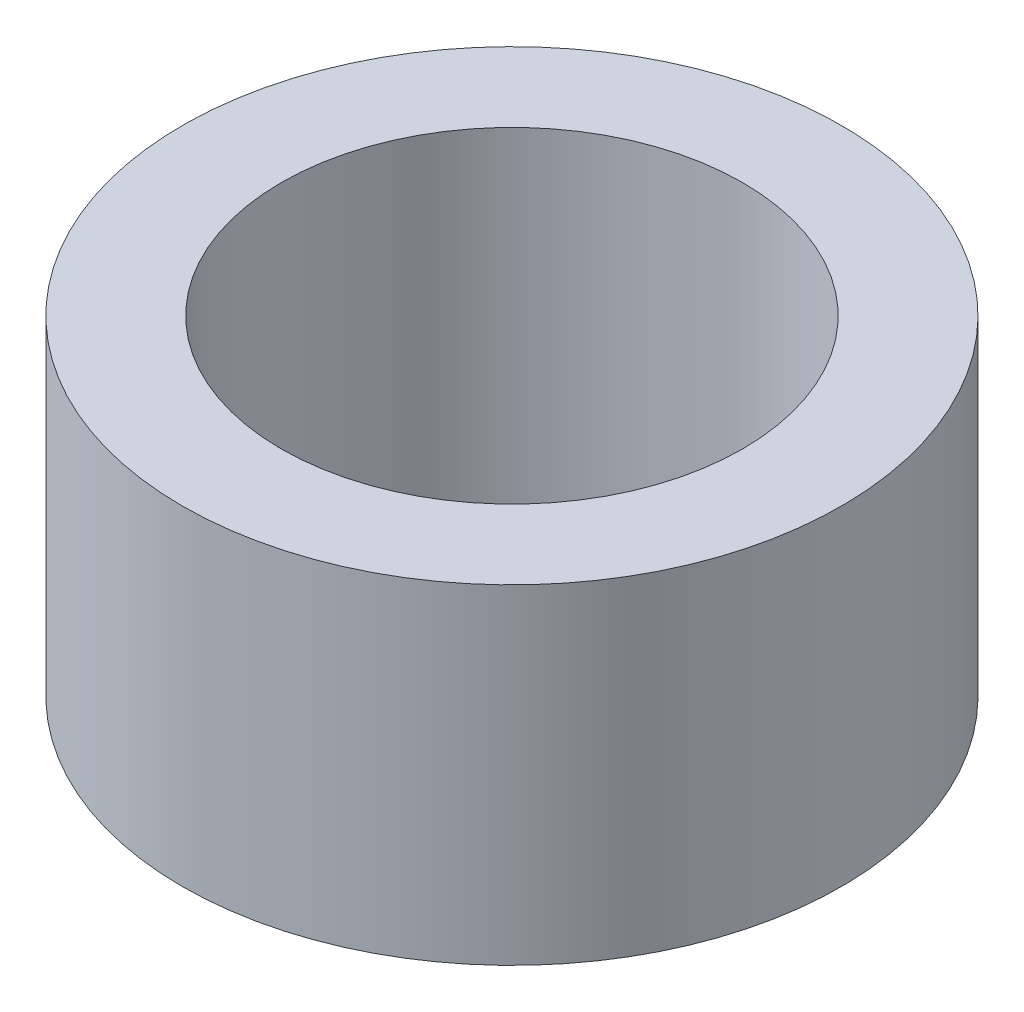
ISO-10303-21;
HEADER;
FILE_DESCRIPTION(('STEP AP214'),'2;1');
FILE_NAME('part.step','',(''),(''),'','','');
FILE_SCHEMA(('AUTOMOTIVE_DESIGN { 1 0 10303 214 1 1 1 1 }'));
ENDSEC;
DATA;
#1=APPLICATION_CONTEXT('core data for automotive mechanical design processes');
#2=APPLICATION_PROTOCOL_DEFINITION('international standard','automotive_design',2000,#1);
#3=PRODUCT_CONTEXT('',#1,'mechanical');
#4=PRODUCT('Part','Part','',(#3));
#5=PRODUCT_RELATED_PRODUCT_CATEGORY('part','',(#4));
#6=PRODUCT_DEFINITION_FORMATION('','',#4);
#7=PRODUCT_DEFINITION_CONTEXT('part definition',#1,'design');
#8=PRODUCT_DEFINITION('design','',#6,#7);
#9=PRODUCT_DEFINITION_SHAPE('','',#8);
#10=(LENGTH_UNIT() NAMED_UNIT(*) SI_UNIT(.MILLI.,.METRE.));
#11=(NAMED_UNIT(*) PLANE_ANGLE_UNIT() SI_UNIT($,.RADIAN.));
#12=(NAMED_UNIT(*) SI_UNIT($,.STERADIAN.) SOLID_ANGLE_UNIT());
#13=UNCERTAINTY_MEASURE_WITH_UNIT(LENGTH_MEASURE(1.E-05),#10,'distance_accuracy_value','');
#14=(GEOMETRIC_REPRESENTATION_CONTEXT(3) GLOBAL_UNCERTAINTY_ASSIGNED_CONTEXT((#13)) GLOBAL_UNIT_ASSIGNED_CONTEXT((#10,
#11,#12)) REPRESENTATION_CONTEXT('',''));
#15=CARTESIAN_POINT('',(0.,0.,0.));
#16=DIRECTION('',(0.,0.,1.));
#17=DIRECTION('',(1.,0.,0.));
#18=AXIS2_PLACEMENT_3D('',#15,#16,#17);
#19=CARTESIAN_POINT('',(0.,3.,0.));
#20=DIRECTION('',(0.,1.,0.));
#21=DIRECTION('',(0.,0.,1.));
#22=AXIS2_PLACEMENT_3D('',#19,#20,#21);
#23=PLANE('',#22);
#24=CARTESIAN_POINT('',(0.,3.,0.));
#25=DIRECTION('',(0.,1.,0.));
#26=DIRECTION('',(0.,0.,1.));
#27=AXIS2_PLACEMENT_3D('',#24,#25,#26);
#28=CIRCLE('',#27,3.);
#29=CARTESIAN_POINT('',(0.,3.,3.));
#30=VERTEX_POINT('',#29);
#31=EDGE_CURVE('E10',#30,#30,#28,.T.);
#32=ORIENTED_EDGE('',*,*,#31,.T.);
#33=EDGE_LOOP('',(#32));
#34=FACE_BOUND('',#33,.T.);
#35=CARTESIAN_POINT('',(0.,3.,0.));
#36=DIRECTION('',(0.,1.,0.));
#37=DIRECTION('',(0.,0.,1.));
#38=AXIS2_PLACEMENT_3D('',#35,#36,#37);
#39=CIRCLE('',#38,2.1);
#40=CARTESIAN_POINT('',(0.,3.,2.1));
#41=VERTEX_POINT('',#40);
#42=EDGE_CURVE('E42',#41,#41,#39,.T.);
#43=ORIENTED_EDGE('',*,*,#42,.F.);
#44=EDGE_LOOP('',(#43));
#45=FACE_BOUND('',#44,.T.);
#46=ADVANCED_FACE('F31',(#34,#45),#23,.T.);
#47=CARTESIAN_POINT('',(0.,0.,0.));
#48=DIRECTION('',(0.,1.,0.));
#49=DIRECTION('',(0.,0.,1.));
#50=AXIS2_PLACEMENT_3D('',#47,#48,#49);
#51=PLANE('',#50);
#52=CARTESIAN_POINT('',(0.,0.,0.));
#53=DIRECTION('',(0.,1.,0.));
#54=DIRECTION('',(0.,0.,1.));
#55=AXIS2_PLACEMENT_3D('',#52,#53,#54);
#56=CIRCLE('',#55,3.);
#57=CARTESIAN_POINT('',(0.,0.,3.));
#58=VERTEX_POINT('',#57);
#59=EDGE_CURVE('E35',#58,#58,#56,.T.);
#60=ORIENTED_EDGE('',*,*,#59,.F.);
#61=EDGE_LOOP('',(#60));
#62=FACE_BOUND('',#61,.T.);
#63=CARTESIAN_POINT('',(0.,0.,0.));
#64=DIRECTION('',(0.,1.,0.));
#65=DIRECTION('',(0.,0.,1.));
#66=AXIS2_PLACEMENT_3D('',#63,#64,#65);
#67=CIRCLE('',#66,2.1);
#68=CARTESIAN_POINT('',(0.,0.,2.1));
#69=VERTEX_POINT('',#68);
#70=EDGE_CURVE('E44',#69,#69,#67,.T.);
#71=ORIENTED_EDGE('',*,*,#70,.T.);
#72=EDGE_LOOP('',(#71));
#73=FACE_BOUND('',#72,.T.);
#74=ADVANCED_FACE('F54',(#62,#73),#51,.F.);
#75=CARTESIAN_POINT('',(0.,3.,0.));
#76=DIRECTION('',(0.,-1.,0.));
#77=DIRECTION('',(0.,0.,-1.));
#78=AXIS2_PLACEMENT_3D('',#75,#76,#77);
#79=CYLINDRICAL_SURFACE('',#78,3.);
#80=ORIENTED_EDGE('',*,*,#31,.F.);
#81=EDGE_LOOP('',(#80));
#82=FACE_BOUND('',#81,.T.);
#83=ORIENTED_EDGE('',*,*,#59,.T.);
#84=EDGE_LOOP('',(#83));
#85=FACE_BOUND('',#84,.T.);
#86=ADVANCED_FACE('F33',(#82,#85),#79,.T.);
#87=CARTESIAN_POINT('',(0.,3.,0.));
#88=DIRECTION('',(0.,-1.,0.));
#89=DIRECTION('',(0.,0.,-1.));
#90=AXIS2_PLACEMENT_3D('',#87,#88,#89);
#91=CYLINDRICAL_SURFACE('',#90,2.1);
#92=ORIENTED_EDGE('',*,*,#42,.T.);
#93=EDGE_LOOP('',(#92));
#94=FACE_BOUND('',#93,.T.);
#95=ORIENTED_EDGE('',*,*,#70,.F.);
#96=EDGE_LOOP('',(#95));
#97=FACE_BOUND('',#96,.T.);
#98=ADVANCED_FACE('F50',(#94,#97),#91,.F.);
#99=CLOSED_SHELL('',(#46,#74,#86,#98));
#100=MANIFOLD_SOLID_BREP('B2',#99);
#101=ADVANCED_BREP_SHAPE_REPRESENTATION('',(#18,#100),#14);
#102=SHAPE_DEFINITION_REPRESENTATION(#9,#101);
ENDSEC;
END-ISO-10303-21;
